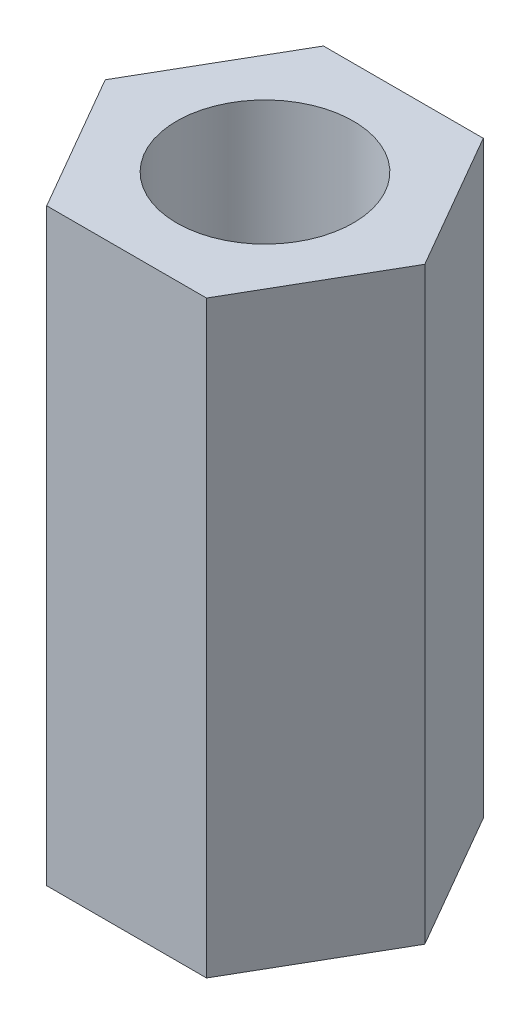
ISO-10303-21;
HEADER;
FILE_DESCRIPTION(('STEP AP214'),'2;1');
FILE_NAME('part.step','',(''),(''),'','','');
FILE_SCHEMA(('AUTOMOTIVE_DESIGN { 1 0 10303 214 1 1 1 1 }'));
ENDSEC;
DATA;
#1=APPLICATION_CONTEXT('core data for automotive mechanical design processes');
#2=APPLICATION_PROTOCOL_DEFINITION('international standard','automotive_design',2000,#1);
#3=PRODUCT_CONTEXT('',#1,'mechanical');
#4=PRODUCT('Part','Part','',(#3));
#5=PRODUCT_RELATED_PRODUCT_CATEGORY('part','',(#4));
#6=PRODUCT_DEFINITION_FORMATION('','',#4);
#7=PRODUCT_DEFINITION_CONTEXT('part definition',#1,'design');
#8=PRODUCT_DEFINITION('design','',#6,#7);
#9=PRODUCT_DEFINITION_SHAPE('','',#8);
#10=(LENGTH_UNIT() NAMED_UNIT(*) SI_UNIT(.MILLI.,.METRE.));
#11=(NAMED_UNIT(*) PLANE_ANGLE_UNIT() SI_UNIT($,.RADIAN.));
#12=(NAMED_UNIT(*) SI_UNIT($,.STERADIAN.) SOLID_ANGLE_UNIT());
#13=UNCERTAINTY_MEASURE_WITH_UNIT(LENGTH_MEASURE(1.E-05),#10,'distance_accuracy_value','');
#14=(GEOMETRIC_REPRESENTATION_CONTEXT(3) GLOBAL_UNCERTAINTY_ASSIGNED_CONTEXT((#13)) GLOBAL_UNIT_ASSIGNED_CONTEXT((#10,
#11,#12)) REPRESENTATION_CONTEXT('',''));
#15=CARTESIAN_POINT('',(0.,0.,0.));
#16=DIRECTION('',(0.,0.,1.));
#17=DIRECTION('',(1.,0.,0.));
#18=AXIS2_PLACEMENT_3D('',#15,#16,#17);
#19=CARTESIAN_POINT('',(0.,10.,0.));
#20=DIRECTION('',(0.,1.,0.));
#21=DIRECTION('',(0.,0.,1.));
#22=AXIS2_PLACEMENT_3D('',#19,#20,#21);
#23=PLANE('',#22);
#24=DIRECTION('',(0.499999999999995,0.,-0.866025403784441));
#25=VECTOR('',#24,1.);
#26=CARTESIAN_POINT('',(1.35677313259565,10.,2.34999999999999));
#27=LINE('',#26,#25);
#28=CARTESIAN_POINT('',(1.35677313259565,10.,2.34999999999999));
#29=VERTEX_POINT('',#28);
#30=CARTESIAN_POINT('',(2.71354626519124,10.,0.));
#31=VERTEX_POINT('',#30);
#32=EDGE_CURVE('E131',#29,#31,#27,.T.);
#33=ORIENTED_EDGE('',*,*,#32,.T.);
#34=DIRECTION('',(-0.500000000000001,0.,-0.866025403784438));
#35=VECTOR('',#34,1.);
#36=CARTESIAN_POINT('',(2.71354626519124,10.,0.));
#37=LINE('',#36,#35);
#38=CARTESIAN_POINT('',(1.35677313259562,10.,-2.35));
#39=VERTEX_POINT('',#38);
#40=EDGE_CURVE('E89',#31,#39,#37,.T.);
#41=ORIENTED_EDGE('',*,*,#40,.T.);
#42=DIRECTION('',(-1.,0.,0.));
#43=VECTOR('',#42,1.);
#44=CARTESIAN_POINT('',(1.35677313259562,10.,-2.35));
#45=LINE('',#44,#43);
#46=CARTESIAN_POINT('',(-1.35677313259563,10.,-2.35));
#47=VERTEX_POINT('',#46);
#48=EDGE_CURVE('E102',#39,#47,#45,.T.);
#49=ORIENTED_EDGE('',*,*,#48,.T.);
#50=DIRECTION('',(-0.499999999999995,0.,0.866025403784441));
#51=VECTOR('',#50,1.);
#52=CARTESIAN_POINT('',(-1.35677313259563,10.,-2.35));
#53=LINE('',#52,#51);
#54=CARTESIAN_POINT('',(-2.71354626519124,10.,0.));
#55=VERTEX_POINT('',#54);
#56=EDGE_CURVE('E96',#47,#55,#53,.T.);
#57=ORIENTED_EDGE('',*,*,#56,.T.);
#58=DIRECTION('',(0.500000000000007,0.,0.866025403784435));
#59=VECTOR('',#58,1.);
#60=CARTESIAN_POINT('',(-2.71354626519124,10.,0.));
#61=LINE('',#60,#59);
#62=CARTESIAN_POINT('',(-1.3567731325956,10.,2.35000000000001));
#63=VERTEX_POINT('',#62);
#64=EDGE_CURVE('E100',#55,#63,#61,.T.);
#65=ORIENTED_EDGE('',*,*,#64,.T.);
#66=DIRECTION('',(1.,0.,0.));
#67=VECTOR('',#66,1.);
#68=CARTESIAN_POINT('',(-1.3567731325956,10.,2.35000000000001));
#69=LINE('',#68,#67);
#70=EDGE_CURVE('E52',#63,#29,#69,.T.);
#71=ORIENTED_EDGE('',*,*,#70,.T.);
#72=EDGE_LOOP('',(#33,#41,#49,#57,#65,#71));
#73=FACE_BOUND('',#72,.T.);
#74=CARTESIAN_POINT('',(0.,10.,0.));
#75=DIRECTION('',(0.,1.,0.));
#76=DIRECTION('',(0.,0.,1.));
#77=AXIS2_PLACEMENT_3D('',#74,#75,#76);
#78=CIRCLE('',#77,1.5);
#79=CARTESIAN_POINT('',(0.,10.,1.5));
#80=VERTEX_POINT('',#79);
#81=EDGE_CURVE('E124',#80,#80,#78,.T.);
#82=ORIENTED_EDGE('',*,*,#81,.F.);
#83=EDGE_LOOP('',(#82));
#84=FACE_BOUND('',#83,.T.);
#85=ADVANCED_FACE('F35',(#73,#84),#23,.T.);
#86=CARTESIAN_POINT('',(0.,0.,0.));
#87=DIRECTION('',(0.,1.,0.));
#88=DIRECTION('',(0.,0.,1.));
#89=AXIS2_PLACEMENT_3D('',#86,#87,#88);
#90=PLANE('',#89);
#91=DIRECTION('',(0.499999999999995,0.,-0.866025403784441));
#92=VECTOR('',#91,1.);
#93=CARTESIAN_POINT('',(1.35677313259565,0.,2.34999999999999));
#94=LINE('',#93,#92);
#95=CARTESIAN_POINT('',(1.35677313259565,0.,2.34999999999999));
#96=VERTEX_POINT('',#95);
#97=CARTESIAN_POINT('',(2.71354626519124,0.,0.));
#98=VERTEX_POINT('',#97);
#99=EDGE_CURVE('E120',#96,#98,#94,.T.);
#100=ORIENTED_EDGE('',*,*,#99,.F.);
#101=DIRECTION('',(1.,0.,0.));
#102=VECTOR('',#101,1.);
#103=CARTESIAN_POINT('',(-1.3567731325956,0.,2.35000000000001));
#104=LINE('',#103,#102);
#105=CARTESIAN_POINT('',(-1.3567731325956,0.,2.35000000000001));
#106=VERTEX_POINT('',#105);
#107=EDGE_CURVE('E81',#106,#96,#104,.T.);
#108=ORIENTED_EDGE('',*,*,#107,.F.);
#109=DIRECTION('',(0.500000000000007,0.,0.866025403784435));
#110=VECTOR('',#109,1.);
#111=CARTESIAN_POINT('',(-2.71354626519124,0.,0.));
#112=LINE('',#111,#110);
#113=CARTESIAN_POINT('',(-2.71354626519124,0.,0.));
#114=VERTEX_POINT('',#113);
#115=EDGE_CURVE('E75',#114,#106,#112,.T.);
#116=ORIENTED_EDGE('',*,*,#115,.F.);
#117=DIRECTION('',(-0.499999999999995,0.,0.866025403784441));
#118=VECTOR('',#117,1.);
#119=CARTESIAN_POINT('',(-1.35677313259563,0.,-2.35));
#120=LINE('',#119,#118);
#121=CARTESIAN_POINT('',(-1.35677313259563,0.,-2.35));
#122=VERTEX_POINT('',#121);
#123=EDGE_CURVE('E110',#122,#114,#120,.T.);
#124=ORIENTED_EDGE('',*,*,#123,.F.);
#125=DIRECTION('',(-1.,0.,0.));
#126=VECTOR('',#125,1.);
#127=CARTESIAN_POINT('',(1.35677313259562,0.,-2.35));
#128=LINE('',#127,#126);
#129=CARTESIAN_POINT('',(1.35677313259562,0.,-2.35));
#130=VERTEX_POINT('',#129);
#131=EDGE_CURVE('E126',#130,#122,#128,.T.);
#132=ORIENTED_EDGE('',*,*,#131,.F.);
#133=DIRECTION('',(-0.500000000000001,0.,-0.866025403784438));
#134=VECTOR('',#133,1.);
#135=CARTESIAN_POINT('',(2.71354626519124,0.,0.));
#136=LINE('',#135,#134);
#137=EDGE_CURVE('E123',#98,#130,#136,.T.);
#138=ORIENTED_EDGE('',*,*,#137,.F.);
#139=EDGE_LOOP('',(#100,#108,#116,#124,#132,#138));
#140=FACE_BOUND('',#139,.T.);
#141=CARTESIAN_POINT('',(0.,0.,0.));
#142=DIRECTION('',(0.,1.,0.));
#143=DIRECTION('',(0.,0.,1.));
#144=AXIS2_PLACEMENT_3D('',#141,#142,#143);
#145=CIRCLE('',#144,1.5);
#146=CARTESIAN_POINT('',(0.,0.,1.5));
#147=VERTEX_POINT('',#146);
#148=EDGE_CURVE('E224',#147,#147,#145,.T.);
#149=ORIENTED_EDGE('',*,*,#148,.T.);
#150=EDGE_LOOP('',(#149));
#151=FACE_BOUND('',#150,.T.);
#152=ADVANCED_FACE('F140',(#140,#151),#90,.F.);
#153=CARTESIAN_POINT('',(1.35677313259565,10.,2.34999999999999));
#154=DIRECTION('',(-0.866025403784442,0.,-0.499999999999995));
#155=DIRECTION('',(-0.499999999999995,0.,0.866025403784442));
#156=AXIS2_PLACEMENT_3D('',#153,#154,#155);
#157=PLANE('',#156);
#158=ORIENTED_EDGE('',*,*,#99,.T.);
#159=DIRECTION('',(0.,-1.,0.));
#160=VECTOR('',#159,1.);
#161=CARTESIAN_POINT('',(2.71354626519124,10.,0.));
#162=LINE('',#161,#160);
#163=EDGE_CURVE('E11',#31,#98,#162,.T.);
#164=ORIENTED_EDGE('',*,*,#163,.F.);
#165=ORIENTED_EDGE('',*,*,#32,.F.);
#166=DIRECTION('',(0.,-1.,0.));
#167=VECTOR('',#166,1.);
#168=CARTESIAN_POINT('',(1.35677313259565,10.,2.34999999999999));
#169=LINE('',#168,#167);
#170=EDGE_CURVE('E116',#29,#96,#169,.T.);
#171=ORIENTED_EDGE('',*,*,#170,.T.);
#172=EDGE_LOOP('',(#158,#164,#165,#171));
#173=FACE_BOUND('',#172,.T.);
#174=ADVANCED_FACE('F37',(#173),#157,.F.);
#175=CARTESIAN_POINT('',(2.71354626519124,10.,0.));
#176=DIRECTION('',(-0.866025403784438,0.,0.500000000000001));
#177=DIRECTION('',(0.500000000000001,0.,0.866025403784438));
#178=AXIS2_PLACEMENT_3D('',#175,#176,#177);
#179=PLANE('',#178);
#180=ORIENTED_EDGE('',*,*,#137,.T.);
#181=DIRECTION('',(0.,-1.,0.));
#182=VECTOR('',#181,1.);
#183=CARTESIAN_POINT('',(1.35677313259562,10.,-2.35));
#184=LINE('',#183,#182);
#185=EDGE_CURVE('E44',#39,#130,#184,.T.);
#186=ORIENTED_EDGE('',*,*,#185,.F.);
#187=ORIENTED_EDGE('',*,*,#40,.F.);
#188=ORIENTED_EDGE('',*,*,#163,.T.);
#189=EDGE_LOOP('',(#180,#186,#187,#188));
#190=FACE_BOUND('',#189,.T.);
#191=ADVANCED_FACE('F165',(#190),#179,.F.);
#192=CARTESIAN_POINT('',(1.35677313259562,10.,-2.35));
#193=DIRECTION('',(0.,0.,1.));
#194=DIRECTION('',(1.,0.,0.));
#195=AXIS2_PLACEMENT_3D('',#192,#193,#194);
#196=PLANE('',#195);
#197=ORIENTED_EDGE('',*,*,#131,.T.);
#198=DIRECTION('',(0.,-1.,0.));
#199=VECTOR('',#198,1.);
#200=CARTESIAN_POINT('',(-1.35677313259563,10.,-2.35));
#201=LINE('',#200,#199);
#202=EDGE_CURVE('E111',#47,#122,#201,.T.);
#203=ORIENTED_EDGE('',*,*,#202,.F.);
#204=ORIENTED_EDGE('',*,*,#48,.F.);
#205=ORIENTED_EDGE('',*,*,#185,.T.);
#206=EDGE_LOOP('',(#197,#203,#204,#205));
#207=FACE_BOUND('',#206,.T.);
#208=ADVANCED_FACE('F137',(#207),#196,.F.);
#209=CARTESIAN_POINT('',(-1.35677313259563,10.,-2.35));
#210=DIRECTION('',(0.866025403784442,0.,0.499999999999995));
#211=DIRECTION('',(0.499999999999995,0.,-0.866025403784442));
#212=AXIS2_PLACEMENT_3D('',#209,#210,#211);
#213=PLANE('',#212);
#214=ORIENTED_EDGE('',*,*,#123,.T.);
#215=DIRECTION('',(0.,-1.,0.));
#216=VECTOR('',#215,1.);
#217=CARTESIAN_POINT('',(-2.71354626519124,10.,0.));
#218=LINE('',#217,#216);
#219=EDGE_CURVE('E107',#55,#114,#218,.T.);
#220=ORIENTED_EDGE('',*,*,#219,.F.);
#221=ORIENTED_EDGE('',*,*,#56,.F.);
#222=ORIENTED_EDGE('',*,*,#202,.T.);
#223=EDGE_LOOP('',(#214,#220,#221,#222));
#224=FACE_BOUND('',#223,.T.);
#225=ADVANCED_FACE('F108',(#224),#213,.F.);
#226=CARTESIAN_POINT('',(-2.71354626519124,10.,0.));
#227=DIRECTION('',(0.866025403784434,0.,-0.500000000000007));
#228=DIRECTION('',(-0.500000000000007,0.,-0.866025403784435));
#229=AXIS2_PLACEMENT_3D('',#226,#227,#228);
#230=PLANE('',#229);
#231=ORIENTED_EDGE('',*,*,#115,.T.);
#232=DIRECTION('',(0.,-1.,0.));
#233=VECTOR('',#232,1.);
#234=CARTESIAN_POINT('',(-1.3567731325956,10.,2.35000000000001));
#235=LINE('',#234,#233);
#236=EDGE_CURVE('E112',#63,#106,#235,.T.);
#237=ORIENTED_EDGE('',*,*,#236,.F.);
#238=ORIENTED_EDGE('',*,*,#64,.F.);
#239=ORIENTED_EDGE('',*,*,#219,.T.);
#240=EDGE_LOOP('',(#231,#237,#238,#239));
#241=FACE_BOUND('',#240,.T.);
#242=ADVANCED_FACE('F114',(#241),#230,.F.);
#243=CARTESIAN_POINT('',(-1.3567731325956,10.,2.35000000000001));
#244=DIRECTION('',(0.,0.,-1.));
#245=DIRECTION('',(-1.,0.,0.));
#246=AXIS2_PLACEMENT_3D('',#243,#244,#245);
#247=PLANE('',#246);
#248=ORIENTED_EDGE('',*,*,#107,.T.);
#249=ORIENTED_EDGE('',*,*,#170,.F.);
#250=ORIENTED_EDGE('',*,*,#70,.F.);
#251=ORIENTED_EDGE('',*,*,#236,.T.);
#252=EDGE_LOOP('',(#248,#249,#250,#251));
#253=FACE_BOUND('',#252,.T.);
#254=ADVANCED_FACE('F145',(#253),#247,.F.);
#255=CARTESIAN_POINT('',(0.,10.,0.));
#256=DIRECTION('',(0.,-1.,0.));
#257=DIRECTION('',(0.,0.,-1.));
#258=AXIS2_PLACEMENT_3D('',#255,#256,#257);
#259=CYLINDRICAL_SURFACE('',#258,1.5);
#260=ORIENTED_EDGE('',*,*,#81,.T.);
#261=EDGE_LOOP('',(#260));
#262=FACE_BOUND('',#261,.T.);
#263=ORIENTED_EDGE('',*,*,#148,.F.);
#264=EDGE_LOOP('',(#263));
#265=FACE_BOUND('',#264,.T.);
#266=ADVANCED_FACE('F147',(#262,#265),#259,.F.);
#267=CLOSED_SHELL('',(#85,#152,#174,#191,#208,#225,#242,#254,#266));
#268=MANIFOLD_SOLID_BREP('B2',#267);
#269=ADVANCED_BREP_SHAPE_REPRESENTATION('',(#18,#268),#14);
#270=SHAPE_DEFINITION_REPRESENTATION(#9,#269);
ENDSEC;
END-ISO-10303-21;
